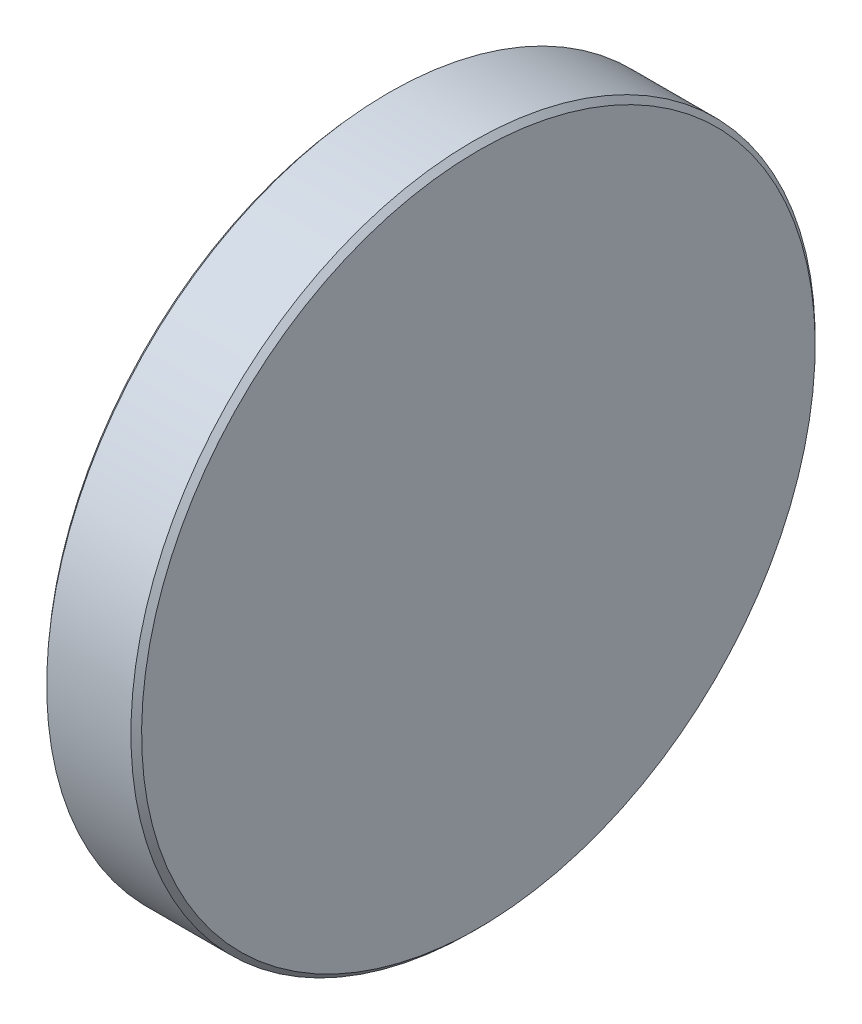
ISO-10303-21;
HEADER;
FILE_DESCRIPTION(('STEP AP214'),'2;1');
FILE_NAME('part.step','',(''),(''),'','','');
FILE_SCHEMA(('AUTOMOTIVE_DESIGN { 1 0 10303 214 1 1 1 1 }'));
ENDSEC;
DATA;
#1=APPLICATION_CONTEXT('core data for automotive mechanical design processes');
#2=APPLICATION_PROTOCOL_DEFINITION('international standard','automotive_design',2000,#1);
#3=PRODUCT_CONTEXT('',#1,'mechanical');
#4=PRODUCT('Part','Part','',(#3));
#5=PRODUCT_RELATED_PRODUCT_CATEGORY('part','',(#4));
#6=PRODUCT_DEFINITION_FORMATION('','',#4);
#7=PRODUCT_DEFINITION_CONTEXT('part definition',#1,'design');
#8=PRODUCT_DEFINITION('design','',#6,#7);
#9=PRODUCT_DEFINITION_SHAPE('','',#8);
#10=(LENGTH_UNIT() NAMED_UNIT(*) SI_UNIT(.MILLI.,.METRE.));
#11=(NAMED_UNIT(*) PLANE_ANGLE_UNIT() SI_UNIT($,.RADIAN.));
#12=(NAMED_UNIT(*) SI_UNIT($,.STERADIAN.) SOLID_ANGLE_UNIT());
#13=UNCERTAINTY_MEASURE_WITH_UNIT(LENGTH_MEASURE(1.E-05),#10,'distance_accuracy_value','');
#14=(GEOMETRIC_REPRESENTATION_CONTEXT(3) GLOBAL_UNCERTAINTY_ASSIGNED_CONTEXT((#13)) GLOBAL_UNIT_ASSIGNED_CONTEXT((#10,
#11,#12)) REPRESENTATION_CONTEXT('',''));
#15=CARTESIAN_POINT('',(0.,0.,0.));
#16=DIRECTION('',(0.,0.,1.));
#17=DIRECTION('',(1.,0.,0.));
#18=AXIS2_PLACEMENT_3D('',#15,#16,#17);
#19=CARTESIAN_POINT('',(-300.5,0.,0.));
#20=DIRECTION('',(1.,0.,0.));
#21=DIRECTION('',(0.,1.,0.));
#22=AXIS2_PLACEMENT_3D('',#19,#20,#21);
#23=SPHERICAL_SURFACE('',#22,300.5);
#24=CARTESIAN_POINT('',(-0.413046305426379,0.,0.));
#25=DIRECTION('',(-1.,0.,0.));
#26=DIRECTION('',(0.,-1.,0.));
#27=AXIS2_PLACEMENT_3D('',#24,#25,#26);
#28=CIRCLE('',#27,15.7502451508167);
#29=CARTESIAN_POINT('',(-0.413046305426377,-15.7502451508167,0.));
#30=VERTEX_POINT('',#29);
#31=EDGE_CURVE('E10',#30,#30,#28,.T.);
#32=ORIENTED_EDGE('',*,*,#31,.T.);
#33=EDGE_LOOP('',(#32));
#34=FACE_BOUND('',#33,.T.);
#35=ADVANCED_FACE('F30',(#34),#23,.F.);
#36=CARTESIAN_POINT('',(4.,16.,0.));
#37=DIRECTION('',(1.,0.,0.));
#38=DIRECTION('',(0.,1.,0.));
#39=AXIS2_PLACEMENT_3D('',#36,#37,#38);
#40=PLANE('',#39);
#41=CARTESIAN_POINT('',(4.,0.,0.));
#42=DIRECTION('',(1.,0.,0.));
#43=DIRECTION('',(0.,1.,0.));
#44=AXIS2_PLACEMENT_3D('',#41,#42,#43);
#45=CIRCLE('',#44,15.75);
#46=CARTESIAN_POINT('',(4.,15.75,0.));
#47=VERTEX_POINT('',#46);
#48=EDGE_CURVE('E45',#47,#47,#45,.T.);
#49=ORIENTED_EDGE('',*,*,#48,.T.);
#50=EDGE_LOOP('',(#49));
#51=FACE_BOUND('',#50,.T.);
#52=ADVANCED_FACE('F51',(#51),#40,.T.);
#53=CARTESIAN_POINT('',(4.,0.,0.));
#54=DIRECTION('',(1.,0.,0.));
#55=DIRECTION('',(0.,1.,0.));
#56=AXIS2_PLACEMENT_3D('',#53,#54,#55);
#57=CYLINDRICAL_SURFACE('',#56,16.);
#58=CARTESIAN_POINT('',(3.75,0.,0.));
#59=DIRECTION('',(1.,0.,0.));
#60=DIRECTION('',(0.,1.,0.));
#61=AXIS2_PLACEMENT_3D('',#58,#59,#60);
#62=CIRCLE('',#61,16.);
#63=CARTESIAN_POINT('',(3.75,16.,0.));
#64=VERTEX_POINT('',#63);
#65=EDGE_CURVE('E37',#64,#64,#62,.F.);
#66=ORIENTED_EDGE('',*,*,#65,.T.);
#67=EDGE_LOOP('',(#66));
#68=FACE_BOUND('',#67,.T.);
#69=CARTESIAN_POINT('',(-0.188577185928129,0.,0.));
#70=DIRECTION('',(-1.,0.,0.));
#71=DIRECTION('',(0.,-1.,0.));
#72=AXIS2_PLACEMENT_3D('',#69,#70,#71);
#73=CIRCLE('',#72,16.);
#74=CARTESIAN_POINT('',(-0.188577185928127,-16.,0.));
#75=VERTEX_POINT('',#74);
#76=EDGE_CURVE('E41',#75,#75,#73,.F.);
#77=ORIENTED_EDGE('',*,*,#76,.T.);
#78=EDGE_LOOP('',(#77));
#79=FACE_BOUND('',#78,.T.);
#80=ADVANCED_FACE('F55',(#68,#79),#57,.T.);
#81=CARTESIAN_POINT('',(4.,0.,0.));
#82=DIRECTION('',(-1.,0.,0.));
#83=DIRECTION('',(0.,-1.,0.));
#84=AXIS2_PLACEMENT_3D('',#81,#82,#83);
#85=CONICAL_SURFACE('',#84,15.75,0.785398163397441);
#86=ORIENTED_EDGE('',*,*,#65,.F.);
#87=EDGE_LOOP('',(#86));
#88=FACE_BOUND('',#87,.T.);
#89=ORIENTED_EDGE('',*,*,#48,.F.);
#90=EDGE_LOOP('',(#89));
#91=FACE_BOUND('',#90,.T.);
#92=ADVANCED_FACE('F53',(#88,#91),#85,.T.);
#93=CARTESIAN_POINT('',(-0.188577185928129,0.,0.));
#94=DIRECTION('',(1.,0.,0.));
#95=DIRECTION('',(0.,1.,0.));
#96=AXIS2_PLACEMENT_3D('',#93,#94,#95);
#97=CONICAL_SURFACE('',#96,16.,0.838667945844057);
#98=ORIENTED_EDGE('',*,*,#31,.F.);
#99=EDGE_LOOP('',(#98));
#100=FACE_BOUND('',#99,.T.);
#101=ORIENTED_EDGE('',*,*,#76,.F.);
#102=EDGE_LOOP('',(#101));
#103=FACE_BOUND('',#102,.T.);
#104=ADVANCED_FACE('F32',(#100,#103),#97,.T.);
#105=CLOSED_SHELL('',(#35,#52,#80,#92,#104));
#106=MANIFOLD_SOLID_BREP('B2',#105);
#107=ADVANCED_BREP_SHAPE_REPRESENTATION('',(#18,#106),#14);
#108=SHAPE_DEFINITION_REPRESENTATION(#9,#107);
ENDSEC;
END-ISO-10303-21;
